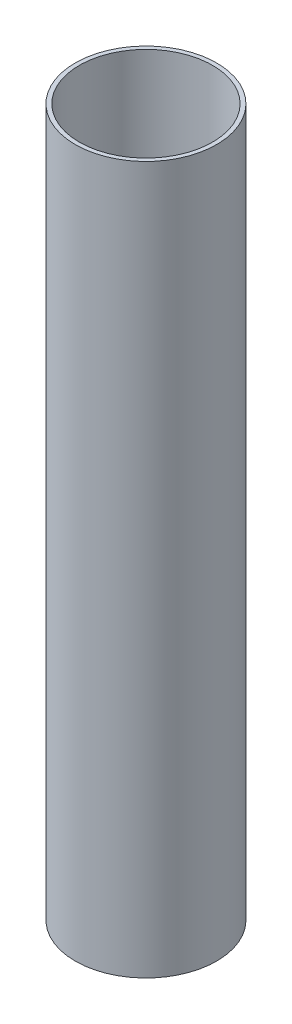
ISO-10303-21;
HEADER;
FILE_DESCRIPTION(('STEP AP214'),'2;1');
FILE_NAME('part.step','',(''),(''),'','','');
FILE_SCHEMA(('AUTOMOTIVE_DESIGN { 1 0 10303 214 1 1 1 1 }'));
ENDSEC;
DATA;
#1=APPLICATION_CONTEXT('core data for automotive mechanical design processes');
#2=APPLICATION_PROTOCOL_DEFINITION('international standard','automotive_design',2000,#1);
#3=PRODUCT_CONTEXT('',#1,'mechanical');
#4=PRODUCT('Part','Part','',(#3));
#5=PRODUCT_RELATED_PRODUCT_CATEGORY('part','',(#4));
#6=PRODUCT_DEFINITION_FORMATION('','',#4);
#7=PRODUCT_DEFINITION_CONTEXT('part definition',#1,'design');
#8=PRODUCT_DEFINITION('design','',#6,#7);
#9=PRODUCT_DEFINITION_SHAPE('','',#8);
#10=(LENGTH_UNIT() NAMED_UNIT(*) SI_UNIT(.MILLI.,.METRE.));
#11=(NAMED_UNIT(*) PLANE_ANGLE_UNIT() SI_UNIT($,.RADIAN.));
#12=(NAMED_UNIT(*) SI_UNIT($,.STERADIAN.) SOLID_ANGLE_UNIT());
#13=UNCERTAINTY_MEASURE_WITH_UNIT(LENGTH_MEASURE(1.E-05),#10,'distance_accuracy_value','');
#14=(GEOMETRIC_REPRESENTATION_CONTEXT(3) GLOBAL_UNCERTAINTY_ASSIGNED_CONTEXT((#13)) GLOBAL_UNIT_ASSIGNED_CONTEXT((#10,
#11,#12)) REPRESENTATION_CONTEXT('',''));
#15=CARTESIAN_POINT('',(0.,0.,0.));
#16=DIRECTION('',(0.,0.,1.));
#17=DIRECTION('',(1.,0.,0.));
#18=AXIS2_PLACEMENT_3D('',#15,#16,#17);
#19=CARTESIAN_POINT('',(0.,0.,0.));
#20=DIRECTION('',(0.,1.,0.));
#21=DIRECTION('',(0.,0.,1.));
#22=AXIS2_PLACEMENT_3D('',#19,#20,#21);
#23=CYLINDRICAL_SURFACE('',#22,6.35);
#24=CARTESIAN_POINT('',(0.,63.5,0.));
#25=DIRECTION('',(0.,1.,0.));
#26=DIRECTION('',(0.,0.,1.));
#27=AXIS2_PLACEMENT_3D('',#24,#25,#26);
#28=CIRCLE('',#27,6.35);
#29=CARTESIAN_POINT('',(0.,63.5,6.35));
#30=VERTEX_POINT('',#29);
#31=EDGE_CURVE('E46',#30,#30,#28,.T.);
#32=ORIENTED_EDGE('',*,*,#31,.F.);
#33=EDGE_LOOP('',(#32));
#34=FACE_BOUND('',#33,.T.);
#35=CARTESIAN_POINT('',(0.,0.,0.));
#36=DIRECTION('',(0.,1.,0.));
#37=DIRECTION('',(0.,0.,1.));
#38=AXIS2_PLACEMENT_3D('',#35,#36,#37);
#39=CIRCLE('',#38,6.35);
#40=CARTESIAN_POINT('',(0.,0.,6.35));
#41=VERTEX_POINT('',#40);
#42=EDGE_CURVE('E37',#41,#41,#39,.T.);
#43=ORIENTED_EDGE('',*,*,#42,.T.);
#44=EDGE_LOOP('',(#43));
#45=FACE_BOUND('',#44,.T.);
#46=ADVANCED_FACE('F34',(#34,#45),#23,.T.);
#47=CARTESIAN_POINT('',(0.,0.,0.));
#48=DIRECTION('',(0.,1.,0.));
#49=DIRECTION('',(0.,0.,1.));
#50=AXIS2_PLACEMENT_3D('',#47,#48,#49);
#51=PLANE('',#50);
#52=CARTESIAN_POINT('',(0.,0.,0.));
#53=DIRECTION('',(0.,1.,0.));
#54=DIRECTION('',(0.,0.,1.));
#55=AXIS2_PLACEMENT_3D('',#52,#53,#54);
#56=CIRCLE('',#55,5.98048882984768);
#57=CARTESIAN_POINT('',(0.,0.,5.98048882984768));
#58=VERTEX_POINT('',#57);
#59=EDGE_CURVE('E41',#58,#58,#56,.F.);
#60=ORIENTED_EDGE('',*,*,#59,.F.);
#61=EDGE_LOOP('',(#60));
#62=FACE_BOUND('',#61,.T.);
#63=ORIENTED_EDGE('',*,*,#42,.F.);
#64=EDGE_LOOP('',(#63));
#65=FACE_BOUND('',#64,.T.);
#66=ADVANCED_FACE('F55',(#62,#65),#51,.F.);
#67=CARTESIAN_POINT('',(0.,63.5,0.));
#68=DIRECTION('',(0.,1.,0.));
#69=DIRECTION('',(0.,0.,1.));
#70=AXIS2_PLACEMENT_3D('',#67,#68,#69);
#71=PLANE('',#70);
#72=CARTESIAN_POINT('',(0.,63.5,0.));
#73=DIRECTION('',(0.,1.,0.));
#74=DIRECTION('',(0.,0.,1.));
#75=AXIS2_PLACEMENT_3D('',#72,#73,#74);
#76=CIRCLE('',#75,5.98048882984768);
#77=CARTESIAN_POINT('',(0.,63.5,5.98048882984768));
#78=VERTEX_POINT('',#77);
#79=EDGE_CURVE('E10',#78,#78,#76,.F.);
#80=ORIENTED_EDGE('',*,*,#79,.T.);
#81=EDGE_LOOP('',(#80));
#82=FACE_BOUND('',#81,.T.);
#83=ORIENTED_EDGE('',*,*,#31,.T.);
#84=EDGE_LOOP('',(#83));
#85=FACE_BOUND('',#84,.T.);
#86=ADVANCED_FACE('F57',(#82,#85),#71,.T.);
#87=CARTESIAN_POINT('',(0.,0.,0.));
#88=DIRECTION('',(0.,1.,0.));
#89=DIRECTION('',(0.,0.,1.));
#90=AXIS2_PLACEMENT_3D('',#87,#88,#89);
#91=CYLINDRICAL_SURFACE('',#90,5.98048882984768);
#92=ORIENTED_EDGE('',*,*,#79,.F.);
#93=EDGE_LOOP('',(#92));
#94=FACE_BOUND('',#93,.T.);
#95=ORIENTED_EDGE('',*,*,#59,.T.);
#96=EDGE_LOOP('',(#95));
#97=FACE_BOUND('',#96,.T.);
#98=ADVANCED_FACE('F63',(#94,#97),#91,.F.);
#99=CLOSED_SHELL('',(#46,#66,#86,#98));
#100=MANIFOLD_SOLID_BREP('B2',#99);
#101=ADVANCED_BREP_SHAPE_REPRESENTATION('',(#18,#100),#14);
#102=SHAPE_DEFINITION_REPRESENTATION(#9,#101);
ENDSEC;
END-ISO-10303-21;
